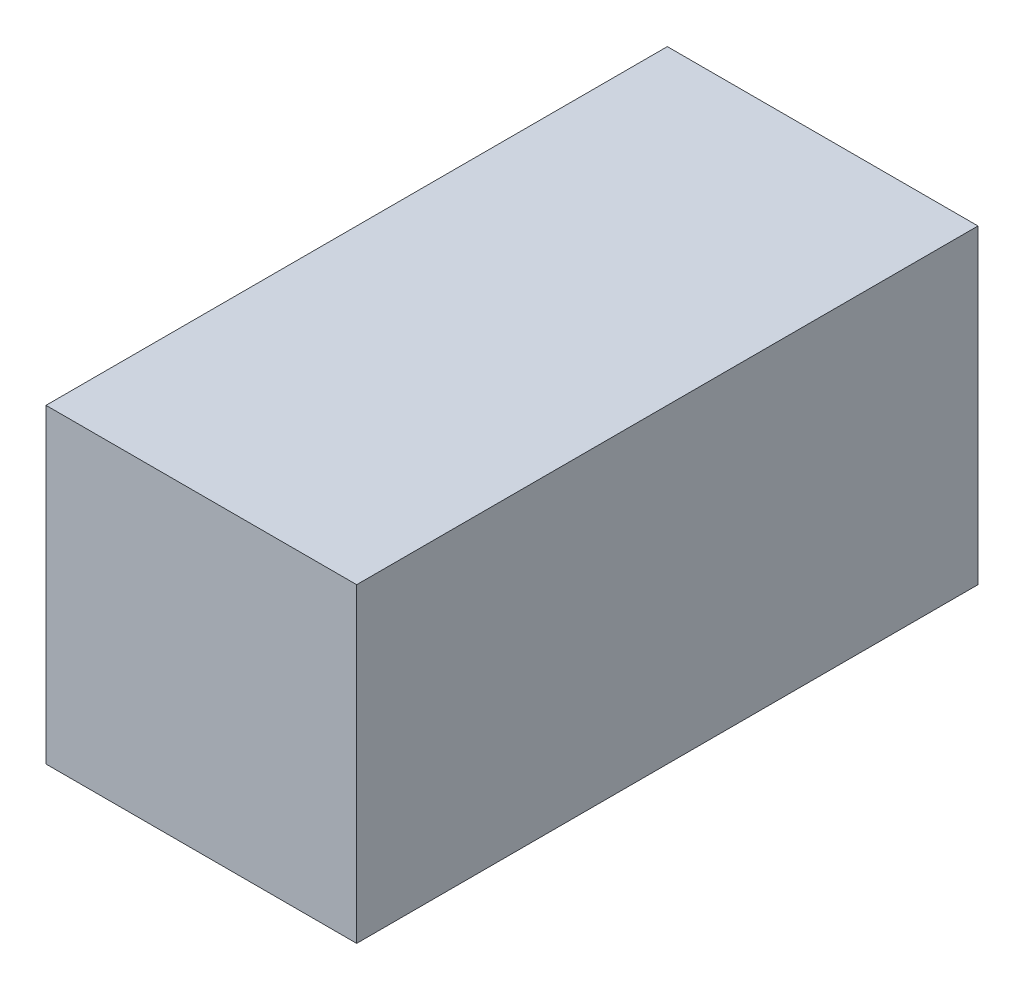
ISO-10303-21;
HEADER;
FILE_DESCRIPTION(('STEP AP214'),'2;1');
FILE_NAME('part.step','',(''),(''),'','','');
FILE_SCHEMA(('AUTOMOTIVE_DESIGN { 1 0 10303 214 1 1 1 1 }'));
ENDSEC;
DATA;
#1=APPLICATION_CONTEXT('core data for automotive mechanical design processes');
#2=APPLICATION_PROTOCOL_DEFINITION('international standard','automotive_design',2000,#1);
#3=PRODUCT_CONTEXT('',#1,'mechanical');
#4=PRODUCT('Part','Part','',(#3));
#5=PRODUCT_RELATED_PRODUCT_CATEGORY('part','',(#4));
#6=PRODUCT_DEFINITION_FORMATION('','',#4);
#7=PRODUCT_DEFINITION_CONTEXT('part definition',#1,'design');
#8=PRODUCT_DEFINITION('design','',#6,#7);
#9=PRODUCT_DEFINITION_SHAPE('','',#8);
#10=(LENGTH_UNIT() NAMED_UNIT(*) SI_UNIT(.MILLI.,.METRE.));
#11=(NAMED_UNIT(*) PLANE_ANGLE_UNIT() SI_UNIT($,.RADIAN.));
#12=(NAMED_UNIT(*) SI_UNIT($,.STERADIAN.) SOLID_ANGLE_UNIT());
#13=UNCERTAINTY_MEASURE_WITH_UNIT(LENGTH_MEASURE(1.E-05),#10,'distance_accuracy_value','');
#14=(GEOMETRIC_REPRESENTATION_CONTEXT(3) GLOBAL_UNCERTAINTY_ASSIGNED_CONTEXT((#13)) GLOBAL_UNIT_ASSIGNED_CONTEXT((#10,
#11,#12)) REPRESENTATION_CONTEXT('',''));
#15=CARTESIAN_POINT('',(0.,0.,0.));
#16=DIRECTION('',(0.,0.,1.));
#17=DIRECTION('',(1.,0.,0.));
#18=AXIS2_PLACEMENT_3D('',#15,#16,#17);
#19=CARTESIAN_POINT('',(2.,-1.99999999999999,8.));
#20=DIRECTION('',(-1.,0.,0.));
#21=DIRECTION('',(0.,0.,1.));
#22=AXIS2_PLACEMENT_3D('',#19,#20,#21);
#23=PLANE('',#22);
#24=DIRECTION('',(0.,1.,0.));
#25=VECTOR('',#24,1.);
#26=CARTESIAN_POINT('',(2.,-1.99999999999999,0.));
#27=LINE('',#26,#25);
#28=CARTESIAN_POINT('',(2.,-1.99999999999999,0.));
#29=VERTEX_POINT('',#28);
#30=CARTESIAN_POINT('',(2.,2.00000000000001,0.));
#31=VERTEX_POINT('',#30);
#32=EDGE_CURVE('E96',#29,#31,#27,.T.);
#33=ORIENTED_EDGE('',*,*,#32,.T.);
#34=DIRECTION('',(0.,0.,-1.));
#35=VECTOR('',#34,1.);
#36=CARTESIAN_POINT('',(2.,2.00000000000001,8.));
#37=LINE('',#36,#35);
#38=CARTESIAN_POINT('',(2.,2.00000000000001,8.));
#39=VERTEX_POINT('',#38);
#40=EDGE_CURVE('E11',#39,#31,#37,.T.);
#41=ORIENTED_EDGE('',*,*,#40,.F.);
#42=DIRECTION('',(0.,1.,0.));
#43=VECTOR('',#42,1.);
#44=CARTESIAN_POINT('',(2.,-1.99999999999999,8.));
#45=LINE('',#44,#43);
#46=CARTESIAN_POINT('',(2.,-1.99999999999999,8.));
#47=VERTEX_POINT('',#46);
#48=EDGE_CURVE('E84',#47,#39,#45,.T.);
#49=ORIENTED_EDGE('',*,*,#48,.F.);
#50=DIRECTION('',(0.,0.,-1.));
#51=VECTOR('',#50,1.);
#52=CARTESIAN_POINT('',(2.,-1.99999999999999,8.));
#53=LINE('',#52,#51);
#54=EDGE_CURVE('E92',#47,#29,#53,.T.);
#55=ORIENTED_EDGE('',*,*,#54,.T.);
#56=EDGE_LOOP('',(#33,#41,#49,#55));
#57=FACE_BOUND('',#56,.T.);
#58=ADVANCED_FACE('F33',(#57),#23,.F.);
#59=CARTESIAN_POINT('',(-2.,2.00000000000001,8.));
#60=DIRECTION('',(0.,-1.,0.));
#61=DIRECTION('',(0.,0.,-1.));
#62=AXIS2_PLACEMENT_3D('',#59,#60,#61);
#63=PLANE('',#62);
#64=DIRECTION('',(-1.,0.,0.));
#65=VECTOR('',#64,1.);
#66=CARTESIAN_POINT('',(-2.,2.00000000000001,0.));
#67=LINE('',#66,#65);
#68=CARTESIAN_POINT('',(-2.,2.00000000000001,0.));
#69=VERTEX_POINT('',#68);
#70=EDGE_CURVE('E88',#31,#69,#67,.T.);
#71=ORIENTED_EDGE('',*,*,#70,.T.);
#72=DIRECTION('',(0.,0.,-1.));
#73=VECTOR('',#72,1.);
#74=CARTESIAN_POINT('',(-2.,2.00000000000001,8.));
#75=LINE('',#74,#73);
#76=CARTESIAN_POINT('',(-2.,2.00000000000001,8.));
#77=VERTEX_POINT('',#76);
#78=EDGE_CURVE('E41',#77,#69,#75,.T.);
#79=ORIENTED_EDGE('',*,*,#78,.F.);
#80=DIRECTION('',(-1.,0.,0.));
#81=VECTOR('',#80,1.);
#82=CARTESIAN_POINT('',(-2.,2.00000000000001,8.));
#83=LINE('',#82,#81);
#84=EDGE_CURVE('E79',#39,#77,#83,.T.);
#85=ORIENTED_EDGE('',*,*,#84,.F.);
#86=ORIENTED_EDGE('',*,*,#40,.T.);
#87=EDGE_LOOP('',(#71,#79,#85,#86));
#88=FACE_BOUND('',#87,.T.);
#89=ADVANCED_FACE('F87',(#88),#63,.F.);
#90=CARTESIAN_POINT('',(-2.,-1.99999999999999,8.));
#91=DIRECTION('',(1.,0.,0.));
#92=DIRECTION('',(0.,0.,-1.));
#93=AXIS2_PLACEMENT_3D('',#90,#91,#92);
#94=PLANE('',#93);
#95=DIRECTION('',(0.,-1.,0.));
#96=VECTOR('',#95,1.);
#97=CARTESIAN_POINT('',(-2.,-1.99999999999999,0.));
#98=LINE('',#97,#96);
#99=CARTESIAN_POINT('',(-2.,-1.99999999999999,0.));
#100=VERTEX_POINT('',#99);
#101=EDGE_CURVE('E66',#69,#100,#98,.T.);
#102=ORIENTED_EDGE('',*,*,#101,.T.);
#103=DIRECTION('',(0.,0.,-1.));
#104=VECTOR('',#103,1.);
#105=CARTESIAN_POINT('',(-2.,-1.99999999999999,8.));
#106=LINE('',#105,#104);
#107=CARTESIAN_POINT('',(-2.,-1.99999999999999,8.));
#108=VERTEX_POINT('',#107);
#109=EDGE_CURVE('E89',#108,#100,#106,.T.);
#110=ORIENTED_EDGE('',*,*,#109,.F.);
#111=DIRECTION('',(0.,-1.,0.));
#112=VECTOR('',#111,1.);
#113=CARTESIAN_POINT('',(-2.,-1.99999999999999,8.));
#114=LINE('',#113,#112);
#115=EDGE_CURVE('E82',#77,#108,#114,.T.);
#116=ORIENTED_EDGE('',*,*,#115,.F.);
#117=ORIENTED_EDGE('',*,*,#78,.T.);
#118=EDGE_LOOP('',(#102,#110,#116,#117));
#119=FACE_BOUND('',#118,.T.);
#120=ADVANCED_FACE('F90',(#119),#94,.F.);
#121=CARTESIAN_POINT('',(-2.,-1.99999999999999,8.));
#122=DIRECTION('',(0.,1.,0.));
#123=DIRECTION('',(0.,0.,1.));
#124=AXIS2_PLACEMENT_3D('',#121,#122,#123);
#125=PLANE('',#124);
#126=DIRECTION('',(1.,0.,0.));
#127=VECTOR('',#126,1.);
#128=CARTESIAN_POINT('',(-2.,-1.99999999999999,0.));
#129=LINE('',#128,#127);
#130=EDGE_CURVE('E72',#100,#29,#129,.T.);
#131=ORIENTED_EDGE('',*,*,#130,.T.);
#132=ORIENTED_EDGE('',*,*,#54,.F.);
#133=DIRECTION('',(1.,0.,0.));
#134=VECTOR('',#133,1.);
#135=CARTESIAN_POINT('',(-2.,-1.99999999999999,8.));
#136=LINE('',#135,#134);
#137=EDGE_CURVE('E49',#108,#47,#136,.T.);
#138=ORIENTED_EDGE('',*,*,#137,.F.);
#139=ORIENTED_EDGE('',*,*,#109,.T.);
#140=EDGE_LOOP('',(#131,#132,#138,#139));
#141=FACE_BOUND('',#140,.T.);
#142=ADVANCED_FACE('F103',(#141),#125,.F.);
#143=CARTESIAN_POINT('',(0.,0.,8.));
#144=DIRECTION('',(0.,0.,-1.));
#145=DIRECTION('',(-1.,0.,0.));
#146=AXIS2_PLACEMENT_3D('',#143,#144,#145);
#147=PLANE('',#146);
#148=ORIENTED_EDGE('',*,*,#48,.T.);
#149=ORIENTED_EDGE('',*,*,#84,.T.);
#150=ORIENTED_EDGE('',*,*,#115,.T.);
#151=ORIENTED_EDGE('',*,*,#137,.T.);
#152=EDGE_LOOP('',(#148,#149,#150,#151));
#153=FACE_BOUND('',#152,.T.);
#154=ADVANCED_FACE('F80',(#153),#147,.F.);
#155=CARTESIAN_POINT('',(0.,0.,0.));
#156=DIRECTION('',(0.,0.,-1.));
#157=DIRECTION('',(-1.,0.,0.));
#158=AXIS2_PLACEMENT_3D('',#155,#156,#157);
#159=PLANE('',#158);
#160=ORIENTED_EDGE('',*,*,#32,.F.);
#161=ORIENTED_EDGE('',*,*,#130,.F.);
#162=ORIENTED_EDGE('',*,*,#101,.F.);
#163=ORIENTED_EDGE('',*,*,#70,.F.);
#164=EDGE_LOOP('',(#160,#161,#162,#163));
#165=FACE_BOUND('',#164,.T.);
#166=ADVANCED_FACE('F106',(#165),#159,.T.);
#167=CLOSED_SHELL('',(#58,#89,#120,#142,#154,#166));
#168=MANIFOLD_SOLID_BREP('B2',#167);
#169=ADVANCED_BREP_SHAPE_REPRESENTATION('',(#18,#168),#14);
#170=SHAPE_DEFINITION_REPRESENTATION(#9,#169);
ENDSEC;
END-ISO-10303-21;
